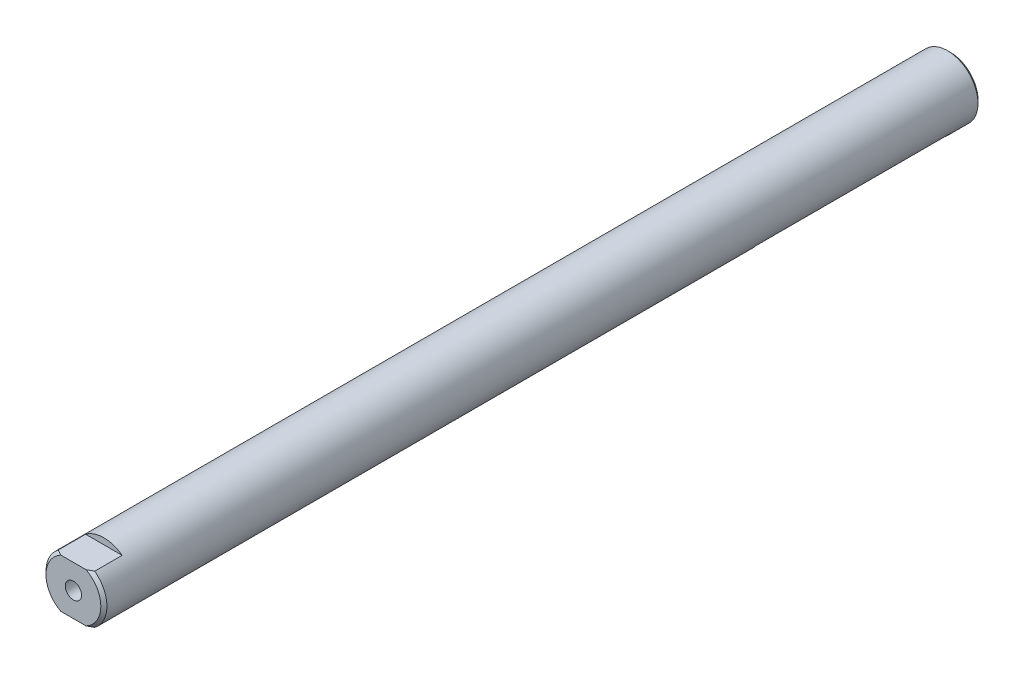
ISO-10303-21;
HEADER;
FILE_DESCRIPTION(('STEP AP214'),'2;1');
FILE_NAME('part.step','',(''),(''),'','','');
FILE_SCHEMA(('AUTOMOTIVE_DESIGN { 1 0 10303 214 1 1 1 1 }'));
ENDSEC;
DATA;
#1=APPLICATION_CONTEXT('core data for automotive mechanical design processes');
#2=APPLICATION_PROTOCOL_DEFINITION('international standard','automotive_design',2000,#1);
#3=PRODUCT_CONTEXT('',#1,'mechanical');
#4=PRODUCT('Part','Part','',(#3));
#5=PRODUCT_RELATED_PRODUCT_CATEGORY('part','',(#4));
#6=PRODUCT_DEFINITION_FORMATION('','',#4);
#7=PRODUCT_DEFINITION_CONTEXT('part definition',#1,'design');
#8=PRODUCT_DEFINITION('design','',#6,#7);
#9=PRODUCT_DEFINITION_SHAPE('','',#8);
#10=(LENGTH_UNIT() NAMED_UNIT(*) SI_UNIT(.MILLI.,.METRE.));
#11=(NAMED_UNIT(*) PLANE_ANGLE_UNIT() SI_UNIT($,.RADIAN.));
#12=(NAMED_UNIT(*) SI_UNIT($,.STERADIAN.) SOLID_ANGLE_UNIT());
#13=UNCERTAINTY_MEASURE_WITH_UNIT(LENGTH_MEASURE(1.E-05),#10,'distance_accuracy_value','');
#14=(GEOMETRIC_REPRESENTATION_CONTEXT(3) GLOBAL_UNCERTAINTY_ASSIGNED_CONTEXT((#13)) GLOBAL_UNIT_ASSIGNED_CONTEXT((#10,
#11,#12)) REPRESENTATION_CONTEXT('',''));
#15=CARTESIAN_POINT('',(0.,0.,0.));
#16=DIRECTION('',(0.,0.,1.));
#17=DIRECTION('',(1.,0.,0.));
#18=AXIS2_PLACEMENT_3D('',#15,#16,#17);
#19=CARTESIAN_POINT('',(0.,0.,228.6));
#20=DIRECTION('',(0.,0.,-1.));
#21=DIRECTION('',(-1.,0.,0.));
#22=AXIS2_PLACEMENT_3D('',#19,#20,#21);
#23=CONICAL_SURFACE('',#22,14.2874999999999,0.78539816339744);
#24=CARTESIAN_POINT('',(-20.9948188362997,12.7,218.350335983573));
#25=CARTESIAN_POINT('',(-20.6810389981544,12.7,218.618804732774));
#26=CARTESIAN_POINT('',(-20.3664721309156,12.7,218.886357316726));
#27=CARTESIAN_POINT('',(-19.7355545060228,12.7,219.419362718427));
#28=CARTESIAN_POINT('',(-19.4192037138988,12.7,219.684815495364));
#29=CARTESIAN_POINT('',(-18.7843580188277,12.7,220.213478769661));
#30=CARTESIAN_POINT('',(-18.4658621006732,12.7,220.4766880489));
#31=CARTESIAN_POINT('',(-17.8266441549003,12.7,221.00038863284));
#32=CARTESIAN_POINT('',(-17.5059221362683,12.7,221.260879948502));
#33=CARTESIAN_POINT('',(-16.8533738177268,12.7,221.785661244857));
#34=CARTESIAN_POINT('',(-16.5214796738842,12.7,222.049866946812));
#35=CARTESIAN_POINT('',(-15.854697810912,12.7,222.574472444557));
#36=CARTESIAN_POINT('',(-15.5198101143849,12.7,222.834872269044));
#37=CARTESIAN_POINT('',(-14.8467056396941,12.7,223.351173728045));
#38=CARTESIAN_POINT('',(-14.5084896634917,12.7,223.607076406674));
#39=CARTESIAN_POINT('',(-13.8281701311778,12.7,224.11366905696));
#40=CARTESIAN_POINT('',(-13.4860665776434,12.7,224.364359032072));
#41=CARTESIAN_POINT('',(-12.7967721374457,12.7,224.860023864054));
#42=CARTESIAN_POINT('',(-12.4495729938879,12.7,225.104987261832));
#43=CARTESIAN_POINT('',(-11.7500506486925,12.7,225.58751304899));
#44=CARTESIAN_POINT('',(-11.3977273876715,12.7,225.825075352498));
#45=CARTESIAN_POINT('',(-10.6868932214396,12.7,226.29148636882));
#46=CARTESIAN_POINT('',(-10.3283770948146,12.7,226.520327149067));
#47=CARTESIAN_POINT('',(-9.60462156620138,12.7,226.967145295869));
#48=CARTESIAN_POINT('',(-9.23938230879352,12.7,227.185122895662));
#49=CARTESIAN_POINT('',(-8.50482232677883,12.7,227.605739392101));
#50=CARTESIAN_POINT('',(-8.13557523539037,12.7,227.808506243445));
#51=CARTESIAN_POINT('',(-7.38862738753812,12.7,228.198039529508));
#52=CARTESIAN_POINT('',(-7.01092565062419,12.7,228.384804096258));
#53=CARTESIAN_POINT('',(-6.24694372230979,12.7,228.738300679871));
#54=CARTESIAN_POINT('',(-5.86067874185389,12.7,228.905065297701));
#55=CARTESIAN_POINT('',(-5.07860833558926,12.7,229.214410810641));
#56=CARTESIAN_POINT('',(-4.68280551684412,12.7,229.356998230575));
#57=CARTESIAN_POINT('',(-3.86926585650531,12.7,229.616923550217));
#58=CARTESIAN_POINT('',(-3.45122968946264,12.7,229.733338300524));
#59=CARTESIAN_POINT('',(-2.60652496572421,12.7,229.929281659109));
#60=CARTESIAN_POINT('',(-2.17985779209242,12.7,230.008816129111));
#61=CARTESIAN_POINT('',(-1.32271329872665,12.7,230.125825087065));
#62=CARTESIAN_POINT('',(-0.89226307482305,12.7,230.163494246296));
#63=CARTESIAN_POINT('',(-0.0297469888855557,12.7,230.194776960431));
#64=CARTESIAN_POINT('',(0.402318811429393,12.7,230.18839218146));
#65=CARTESIAN_POINT('',(1.26277243834431,12.7,230.132088992262));
#66=CARTESIAN_POINT('',(1.6911654471833,12.7,230.082248181792));
#67=CARTESIAN_POINT('',(2.54130881142096,12.7,229.942531658501));
#68=CARTESIAN_POINT('',(2.96305806095029,12.7,229.852649352082));
#69=CARTESIAN_POINT('',(3.80002602264688,12.7,229.637387299877));
#70=CARTESIAN_POINT('',(4.21518936098779,12.7,229.511794823333));
#71=CARTESIAN_POINT('',(4.83020187333967,12.7,229.301341614428));
#72=CARTESIAN_POINT('',(5.03392626223813,12.7,229.227509321276));
#73=CARTESIAN_POINT('',(5.43883446667615,12.7,229.073162346875));
#74=CARTESIAN_POINT('',(5.64001823021926,12.7,228.992647529117));
#75=CARTESIAN_POINT('',(6.36926105525524,12.7,228.687996263877));
#76=CARTESIAN_POINT('',(6.88981055959412,12.7,228.445771006934));
#77=CARTESIAN_POINT('',(7.91497854574205,12.7,227.929538854274));
#78=CARTESIAN_POINT('',(8.41958691329599,12.7,227.655512276938));
#79=CARTESIAN_POINT('',(9.41605100217623,12.7,227.082896746106));
#80=CARTESIAN_POINT('',(9.9078762336554,12.7,226.784255094586));
#81=CARTESIAN_POINT('',(10.8797375560119,12.7,226.168726579235));
#82=CARTESIAN_POINT('',(11.359776164907,12.7,225.851843661591));
#83=CARTESIAN_POINT('',(12.312374837401,12.7,225.202402729927));
#84=CARTESIAN_POINT('',(12.7848894761625,12.7,224.869778391217));
#85=CARTESIAN_POINT('',(13.7218109324975,12.7,224.193300294929));
#86=CARTESIAN_POINT('',(14.1862174033936,12.7,223.849446058994));
#87=CARTESIAN_POINT('',(15.1077211529983,12.7,223.153207664387));
#88=CARTESIAN_POINT('',(15.5648263343014,12.7,222.800833936276));
#89=CARTESIAN_POINT('',(16.4733674697893,12.7,222.088889224434));
#90=CARTESIAN_POINT('',(16.924803567858,12.7,221.729318423971));
#91=CARTESIAN_POINT('',(17.6805264197386,12.7,221.11921262247));
#92=CARTESIAN_POINT('',(17.9860878320288,12.7,220.870252444903));
#93=CARTESIAN_POINT('',(18.595261628336,12.7,220.369872138897));
#94=CARTESIAN_POINT('',(18.8988737322402,12.7,220.118451669464));
#95=CARTESIAN_POINT('',(19.5021312979589,12.7,219.615293067488));
#96=CARTESIAN_POINT('',(19.8017895769666,12.7,219.363570288391));
#97=CARTESIAN_POINT('',(20.3994738760259,12.7,218.858284882059));
#98=CARTESIAN_POINT('',(20.6975001352675,12.7,218.604722537824));
#99=CARTESIAN_POINT('',(20.9948188362997,12.7,218.350335983573));
#100=B_SPLINE_CURVE_WITH_KNOTS('',3,(#24,#25,#26,#27,#28,#29,#30,#31,#32,#33,#34,#35,#36,#37,
#38,#39,#40,#41,#42,#43,#44,#45,#46,#47,#48,#49,#50,#51,#52,#53,#54,#55,#56,#57,#58,#59,#60,#61,
#62,#63,#64,#65,#66,#67,#68,#69,#70,#71,#72,#73,#74,#75,#76,#77,#78,#79,#80,#81,#82,#83,#84,#85,
#86,#87,#88,#89,#90,#91,#92,#93,#94,#95,#96,#97,#98,#99),.UNSPECIFIED.,.F.,.F.,(4,2,2,2,2,2,2,2,
2,2,2,2,2,2,2,2,2,2,2,2,2,2,2,2,2,2,2,2,2,2,2,2,2,2,2,2,2,4),(0.,1.23887197122443,
2.47776796324673,3.71729850973194,4.95682405535293,6.22944510945203,7.50205656288832,
8.77436853917409,10.0466796721009,11.3213499687312,12.5960350493104,13.8718531064865,
15.1476437593001,16.4110961074993,17.6746957399557,18.9362068063337,20.1973768785243,
21.4977685024829,22.7979533722386,24.0920668279409,25.3861313404154,26.6778897541586,
27.9698609592972,29.2696959472478,29.9196717707465,30.5696608751648,32.2904534894359,
34.0123168276933,35.7379673131955,37.463245876527,39.1965859493598,40.9299999532613,
42.6613896046517,44.3927352234191,45.5751531409773,46.7577373291075,47.9317971159513,
49.1056799614727),.UNSPECIFIED.);
#101=CARTESIAN_POINT('',(-9.52500000000003,12.7,227.0125));
#102=VERTEX_POINT('',#101);
#103=CARTESIAN_POINT('',(-6.5454301806678,12.7,228.6));
#104=VERTEX_POINT('',#103);
#105=EDGE_CURVE('E239',#102,#104,#100,.T.);
#106=ORIENTED_EDGE('',*,*,#105,.F.);
#107=CARTESIAN_POINT('',(0.,0.,227.0125));
#108=DIRECTION('',(0.,0.,1.));
#109=DIRECTION('',(1.,0.,0.));
#110=AXIS2_PLACEMENT_3D('',#107,#108,#109);
#111=CIRCLE('',#110,15.875);
#112=CARTESIAN_POINT('',(-9.52500000000003,-12.7,227.0125));
#113=VERTEX_POINT('',#112);
#114=EDGE_CURVE('E161',#113,#102,#111,.F.);
#115=ORIENTED_EDGE('',*,*,#114,.F.);
#116=CARTESIAN_POINT('',(20.9948188362997,-12.7,218.350335983573));
#117=CARTESIAN_POINT('',(20.6810389981544,-12.7,218.618804732774));
#118=CARTESIAN_POINT('',(20.3664721309156,-12.7,218.886357316726));
#119=CARTESIAN_POINT('',(19.7355545060228,-12.7,219.419362718427));
#120=CARTESIAN_POINT('',(19.4192037138988,-12.7,219.684815495364));
#121=CARTESIAN_POINT('',(18.7843580188277,-12.7,220.213478769661));
#122=CARTESIAN_POINT('',(18.4658621006732,-12.7,220.4766880489));
#123=CARTESIAN_POINT('',(17.8266441549003,-12.7,221.00038863284));
#124=CARTESIAN_POINT('',(17.5059221362683,-12.7,221.260879948502));
#125=CARTESIAN_POINT('',(16.8533738177268,-12.7,221.785661244857));
#126=CARTESIAN_POINT('',(16.5214796738842,-12.7,222.049866946812));
#127=CARTESIAN_POINT('',(15.854697810912,-12.7,222.574472444557));
#128=CARTESIAN_POINT('',(15.5198101143849,-12.7,222.834872269044));
#129=CARTESIAN_POINT('',(14.8467056396941,-12.7,223.351173728045));
#130=CARTESIAN_POINT('',(14.5084896634917,-12.7,223.607076406674));
#131=CARTESIAN_POINT('',(13.8281701311778,-12.7,224.11366905696));
#132=CARTESIAN_POINT('',(13.4860665776434,-12.7,224.364359032072));
#133=CARTESIAN_POINT('',(12.7967721374457,-12.7,224.860023864054));
#134=CARTESIAN_POINT('',(12.4495729938879,-12.7,225.104987261832));
#135=CARTESIAN_POINT('',(11.7500506486925,-12.7,225.58751304899));
#136=CARTESIAN_POINT('',(11.3977273876715,-12.7,225.825075352498));
#137=CARTESIAN_POINT('',(10.6868932214396,-12.7,226.29148636882));
#138=CARTESIAN_POINT('',(10.3283770948146,-12.7,226.520327149067));
#139=CARTESIAN_POINT('',(9.60462156620138,-12.7,226.967145295869));
#140=CARTESIAN_POINT('',(9.23938230879352,-12.7,227.185122895662));
#141=CARTESIAN_POINT('',(8.50482232677883,-12.7,227.605739392101));
#142=CARTESIAN_POINT('',(8.13557523539037,-12.7,227.808506243445));
#143=CARTESIAN_POINT('',(7.38862738753812,-12.7,228.198039529508));
#144=CARTESIAN_POINT('',(7.01092565062419,-12.7,228.384804096258));
#145=CARTESIAN_POINT('',(6.24694372230979,-12.7,228.738300679871));
#146=CARTESIAN_POINT('',(5.86067874185389,-12.7,228.905065297701));
#147=CARTESIAN_POINT('',(5.07860833558926,-12.7,229.214410810641));
#148=CARTESIAN_POINT('',(4.68280551684412,-12.7,229.356998230575));
#149=CARTESIAN_POINT('',(3.86926585650531,-12.7,229.616923550217));
#150=CARTESIAN_POINT('',(3.45122968946264,-12.7,229.733338300524));
#151=CARTESIAN_POINT('',(2.60652496572421,-12.7,229.929281659109));
#152=CARTESIAN_POINT('',(2.17985779209242,-12.7,230.008816129111));
#153=CARTESIAN_POINT('',(1.32271329872665,-12.7,230.125825087065));
#154=CARTESIAN_POINT('',(0.89226307482305,-12.7,230.163494246296));
#155=CARTESIAN_POINT('',(0.0297469888855557,-12.7,230.194776960431));
#156=CARTESIAN_POINT('',(-0.402318811429393,-12.7,230.18839218146));
#157=CARTESIAN_POINT('',(-1.26277243834431,-12.7,230.132088992262));
#158=CARTESIAN_POINT('',(-1.6911654471833,-12.7,230.082248181792));
#159=CARTESIAN_POINT('',(-2.54130881142096,-12.7,229.942531658501));
#160=CARTESIAN_POINT('',(-2.96305806095029,-12.7,229.852649352082));
#161=CARTESIAN_POINT('',(-3.80002602264688,-12.7,229.637387299877));
#162=CARTESIAN_POINT('',(-4.21518936098779,-12.7,229.511794823333));
#163=CARTESIAN_POINT('',(-4.83020187333967,-12.7,229.301341614428));
#164=CARTESIAN_POINT('',(-5.03392626223813,-12.7,229.227509321276));
#165=CARTESIAN_POINT('',(-5.43883446667615,-12.7,229.073162346875));
#166=CARTESIAN_POINT('',(-5.64001823021926,-12.7,228.992647529117));
#167=CARTESIAN_POINT('',(-6.36926105525524,-12.7,228.687996263877));
#168=CARTESIAN_POINT('',(-6.88981055959412,-12.7,228.445771006934));
#169=CARTESIAN_POINT('',(-7.91497854574205,-12.7,227.929538854274));
#170=CARTESIAN_POINT('',(-8.41958691329599,-12.7,227.655512276938));
#171=CARTESIAN_POINT('',(-9.41605100217623,-12.7,227.082896746106));
#172=CARTESIAN_POINT('',(-9.9078762336554,-12.7,226.784255094586));
#173=CARTESIAN_POINT('',(-10.8797375560119,-12.7,226.168726579235));
#174=CARTESIAN_POINT('',(-11.359776164907,-12.7,225.851843661591));
#175=CARTESIAN_POINT('',(-12.312374837401,-12.7,225.202402729927));
#176=CARTESIAN_POINT('',(-12.7848894761625,-12.7,224.869778391217));
#177=CARTESIAN_POINT('',(-13.7218109324975,-12.7,224.193300294929));
#178=CARTESIAN_POINT('',(-14.1862174033936,-12.7,223.849446058994));
#179=CARTESIAN_POINT('',(-15.1077211529983,-12.7,223.153207664387));
#180=CARTESIAN_POINT('',(-15.5648263343014,-12.7,222.800833936276));
#181=CARTESIAN_POINT('',(-16.4733674697893,-12.7,222.088889224434));
#182=CARTESIAN_POINT('',(-16.924803567858,-12.7,221.729318423971));
#183=CARTESIAN_POINT('',(-17.6805264197386,-12.7,221.11921262247));
#184=CARTESIAN_POINT('',(-17.9860878320288,-12.7,220.870252444903));
#185=CARTESIAN_POINT('',(-18.595261628336,-12.7,220.369872138897));
#186=CARTESIAN_POINT('',(-18.8988737322402,-12.7,220.118451669464));
#187=CARTESIAN_POINT('',(-19.5021312979589,-12.7,219.615293067488));
#188=CARTESIAN_POINT('',(-19.8017895769666,-12.7,219.363570288391));
#189=CARTESIAN_POINT('',(-20.3994738760259,-12.7,218.858284882059));
#190=CARTESIAN_POINT('',(-20.6975001352675,-12.7,218.604722537824));
#191=CARTESIAN_POINT('',(-20.9948188362997,-12.7,218.350335983573));
#192=B_SPLINE_CURVE_WITH_KNOTS('',3,(#116,#117,#118,#119,#120,#121,#122,#123,#124,#125,#126,
#127,#128,#129,#130,#131,#132,#133,#134,#135,#136,#137,#138,#139,#140,#141,#142,#143,#144,#145,
#146,#147,#148,#149,#150,#151,#152,#153,#154,#155,#156,#157,#158,#159,#160,#161,#162,#163,#164,
#165,#166,#167,#168,#169,#170,#171,#172,#173,#174,#175,#176,#177,#178,#179,#180,#181,#182,#183,
#184,#185,#186,#187,#188,#189,#190,#191),.UNSPECIFIED.,.F.,.F.,(4,2,2,2,2,2,2,2,2,2,2,2,2,2,2,2,
2,2,2,2,2,2,2,2,2,2,2,2,2,2,2,2,2,2,2,2,2,4),(0.,1.23887197122443,2.47776796324673,
3.71729850973194,4.95682405535293,6.22944510945203,7.50205656288832,8.77436853917409,
10.0466796721009,11.3213499687312,12.5960350493104,13.8718531064865,15.1476437593001,
16.4110961074993,17.6746957399557,18.9362068063337,20.1973768785243,21.4977685024829,
22.7979533722386,24.0920668279409,25.3861313404154,26.6778897541586,27.9698609592972,
29.2696959472478,29.9196717707465,30.5696608751648,32.2904534894359,34.0123168276933,
35.7379673131955,37.463245876527,39.1965859493598,40.9299999532613,42.6613896046517,
44.3927352234191,45.5751531409773,46.7577373291075,47.9317971159513,49.1056799614727),.UNSPECIFIED.);
#193=CARTESIAN_POINT('',(-6.54543018066781,-12.7,228.6));
#194=VERTEX_POINT('',#193);
#195=EDGE_CURVE('E165',#194,#113,#192,.T.);
#196=ORIENTED_EDGE('',*,*,#195,.F.);
#197=CARTESIAN_POINT('',(0.,0.,228.6));
#198=DIRECTION('',(0.,0.,1.));
#199=DIRECTION('',(1.,0.,0.));
#200=AXIS2_PLACEMENT_3D('',#197,#198,#199);
#201=CIRCLE('',#200,14.2874999999999);
#202=EDGE_CURVE('E154',#104,#194,#201,.T.);
#203=ORIENTED_EDGE('',*,*,#202,.F.);
#204=EDGE_LOOP('',(#106,#115,#196,#203));
#205=FACE_BOUND('',#204,.T.);
#206=ADVANCED_FACE('F36',(#205),#23,.T.);
#207=CARTESIAN_POINT('',(0.,0.,228.6));
#208=DIRECTION('',(0.,0.,-1.));
#209=DIRECTION('',(-1.,0.,0.));
#210=AXIS2_PLACEMENT_3D('',#207,#208,#209);
#211=CYLINDRICAL_SURFACE('',#210,15.875);
#212=ORIENTED_EDGE('',*,*,#114,.T.);
#213=DIRECTION('',(0.,0.,1.));
#214=VECTOR('',#213,1.);
#215=CARTESIAN_POINT('',(-9.52500000000003,12.7,212.725));
#216=LINE('',#215,#214);
#217=CARTESIAN_POINT('',(-9.52500000000003,12.7,212.725));
#218=VERTEX_POINT('',#217);
#219=EDGE_CURVE('E121',#218,#102,#216,.T.);
#220=ORIENTED_EDGE('',*,*,#219,.F.);
#221=CARTESIAN_POINT('',(0.,0.,212.725));
#222=DIRECTION('',(0.,0.,1.));
#223=DIRECTION('',(1.,0.,0.));
#224=AXIS2_PLACEMENT_3D('',#221,#222,#223);
#225=CIRCLE('',#224,15.875);
#226=CARTESIAN_POINT('',(9.52500000000003,12.7,212.725));
#227=VERTEX_POINT('',#226);
#228=EDGE_CURVE('E11',#227,#218,#225,.T.);
#229=ORIENTED_EDGE('',*,*,#228,.F.);
#230=DIRECTION('',(0.,0.,1.));
#231=VECTOR('',#230,1.);
#232=CARTESIAN_POINT('',(9.52500000000003,12.7,212.725));
#233=LINE('',#232,#231);
#234=CARTESIAN_POINT('',(9.52500000000003,12.7,227.0125));
#235=VERTEX_POINT('',#234);
#236=EDGE_CURVE('E124',#227,#235,#233,.T.);
#237=ORIENTED_EDGE('',*,*,#236,.T.);
#238=CARTESIAN_POINT('',(9.52500000000003,-12.7,227.0125));
#239=VERTEX_POINT('',#238);
#240=EDGE_CURVE('E158',#235,#239,#111,.F.);
#241=ORIENTED_EDGE('',*,*,#240,.T.);
#242=DIRECTION('',(0.,0.,1.));
#243=VECTOR('',#242,1.);
#244=CARTESIAN_POINT('',(9.52500000000003,-12.7,212.725));
#245=LINE('',#244,#243);
#246=CARTESIAN_POINT('',(9.52500000000003,-12.7,212.725));
#247=VERTEX_POINT('',#246);
#248=EDGE_CURVE('E130',#247,#239,#245,.T.);
#249=ORIENTED_EDGE('',*,*,#248,.F.);
#250=CARTESIAN_POINT('',(0.,0.,212.725));
#251=DIRECTION('',(0.,0.,-1.));
#252=DIRECTION('',(-1.,0.,0.));
#253=AXIS2_PLACEMENT_3D('',#250,#251,#252);
#254=CIRCLE('',#253,15.875);
#255=CARTESIAN_POINT('',(-9.52500000000003,-12.7,212.725));
#256=VERTEX_POINT('',#255);
#257=EDGE_CURVE('E44',#247,#256,#254,.T.);
#258=ORIENTED_EDGE('',*,*,#257,.T.);
#259=DIRECTION('',(0.,0.,1.));
#260=VECTOR('',#259,1.);
#261=CARTESIAN_POINT('',(-9.52500000000003,-12.7,212.725));
#262=LINE('',#261,#260);
#263=EDGE_CURVE('E123',#256,#113,#262,.T.);
#264=ORIENTED_EDGE('',*,*,#263,.T.);
#265=EDGE_LOOP('',(#212,#220,#229,#237,#241,#249,#258,#264));
#266=FACE_BOUND('',#265,.T.);
#267=CARTESIAN_POINT('',(0.,0.,-227.0125));
#268=DIRECTION('',(0.,0.,1.));
#269=DIRECTION('',(1.,0.,0.));
#270=AXIS2_PLACEMENT_3D('',#267,#268,#269);
#271=CIRCLE('',#270,15.875);
#272=CARTESIAN_POINT('',(15.875,0.,-227.0125));
#273=VERTEX_POINT('',#272);
#274=EDGE_CURVE('E155',#273,#273,#271,.T.);
#275=ORIENTED_EDGE('',*,*,#274,.T.);
#276=EDGE_LOOP('',(#275));
#277=FACE_BOUND('',#276,.T.);
#278=CARTESIAN_POINT('',(0.,0.,-114.173));
#279=DIRECTION('',(0.,0.,-1.));
#280=DIRECTION('',(-1.,0.,0.));
#281=AXIS2_PLACEMENT_3D('',#278,#279,#280);
#282=CIRCLE('',#281,15.875);
#283=CARTESIAN_POINT('',(12.7,-9.525,-114.173));
#284=VERTEX_POINT('',#283);
#285=CARTESIAN_POINT('',(-12.7,-9.525,-114.173));
#286=VERTEX_POINT('',#285);
#287=EDGE_CURVE('E145',#284,#286,#282,.T.);
#288=ORIENTED_EDGE('',*,*,#287,.F.);
#289=DIRECTION('',(0.,0.,-1.));
#290=VECTOR('',#289,1.);
#291=CARTESIAN_POINT('',(12.7,-9.525,228.6));
#292=LINE('',#291,#290);
#293=CARTESIAN_POINT('',(12.7,-9.525,-216.154));
#294=VERTEX_POINT('',#293);
#295=EDGE_CURVE('E148',#284,#294,#292,.T.);
#296=ORIENTED_EDGE('',*,*,#295,.T.);
#297=CARTESIAN_POINT('',(0.,0.,-216.154));
#298=DIRECTION('',(0.,0.,1.));
#299=DIRECTION('',(1.,0.,0.));
#300=AXIS2_PLACEMENT_3D('',#297,#298,#299);
#301=CIRCLE('',#300,15.875);
#302=CARTESIAN_POINT('',(-12.7,-9.525,-216.154));
#303=VERTEX_POINT('',#302);
#304=EDGE_CURVE('E143',#303,#294,#301,.T.);
#305=ORIENTED_EDGE('',*,*,#304,.F.);
#306=DIRECTION('',(0.,0.,-1.));
#307=VECTOR('',#306,1.);
#308=CARTESIAN_POINT('',(-12.7,-9.525,228.6));
#309=LINE('',#308,#307);
#310=EDGE_CURVE('E140',#303,#286,#309,.F.);
#311=ORIENTED_EDGE('',*,*,#310,.T.);
#312=EDGE_LOOP('',(#288,#296,#305,#311));
#313=FACE_BOUND('',#312,.T.);
#314=ADVANCED_FACE('F205',(#266,#277,#313),#211,.T.);
#315=CARTESIAN_POINT('',(0.,0.,228.6));
#316=DIRECTION('',(0.,0.,1.));
#317=DIRECTION('',(1.,0.,0.));
#318=AXIS2_PLACEMENT_3D('',#315,#316,#317);
#319=PLANE('',#318);
#320=CARTESIAN_POINT('',(0.,0.,228.6));
#321=DIRECTION('',(0.,0.,1.));
#322=DIRECTION('',(1.,0.,0.));
#323=AXIS2_PLACEMENT_3D('',#320,#321,#322);
#324=CIRCLE('',#323,4.25);
#325=CARTESIAN_POINT('',(4.25,0.,228.6));
#326=VERTEX_POINT('',#325);
#327=EDGE_CURVE('E111',#326,#326,#324,.T.);
#328=ORIENTED_EDGE('',*,*,#327,.F.);
#329=EDGE_LOOP('',(#328));
#330=FACE_BOUND('',#329,.T.);
#331=DIRECTION('',(1.,0.,0.));
#332=VECTOR('',#331,1.);
#333=CARTESIAN_POINT('',(-9.52500000000003,12.7,228.6));
#334=LINE('',#333,#332);
#335=CARTESIAN_POINT('',(6.54543018066781,12.7,228.6));
#336=VERTEX_POINT('',#335);
#337=EDGE_CURVE('E59',#104,#336,#334,.T.);
#338=ORIENTED_EDGE('',*,*,#337,.F.);
#339=ORIENTED_EDGE('',*,*,#202,.T.);
#340=DIRECTION('',(-1.,0.,0.));
#341=VECTOR('',#340,1.);
#342=CARTESIAN_POINT('',(-9.52500000000003,-12.7,228.6));
#343=LINE('',#342,#341);
#344=CARTESIAN_POINT('',(6.5454301806678,-12.7,228.6));
#345=VERTEX_POINT('',#344);
#346=EDGE_CURVE('E51',#345,#194,#343,.T.);
#347=ORIENTED_EDGE('',*,*,#346,.F.);
#348=EDGE_CURVE('E151',#345,#336,#201,.T.);
#349=ORIENTED_EDGE('',*,*,#348,.T.);
#350=EDGE_LOOP('',(#338,#339,#347,#349));
#351=FACE_BOUND('',#350,.T.);
#352=ADVANCED_FACE('F202',(#330,#351),#319,.T.);
#353=CARTESIAN_POINT('',(0.,0.,-228.6));
#354=DIRECTION('',(0.,0.,1.));
#355=DIRECTION('',(1.,0.,0.));
#356=AXIS2_PLACEMENT_3D('',#353,#354,#355);
#357=PLANE('',#356);
#358=CARTESIAN_POINT('',(0.,0.,-228.6));
#359=DIRECTION('',(0.,0.,1.));
#360=DIRECTION('',(1.,0.,0.));
#361=AXIS2_PLACEMENT_3D('',#358,#359,#360);
#362=CIRCLE('',#361,14.2875);
#363=CARTESIAN_POINT('',(14.2875,0.,-228.6));
#364=VERTEX_POINT('',#363);
#365=EDGE_CURVE('E162',#364,#364,#362,.F.);
#366=ORIENTED_EDGE('',*,*,#365,.T.);
#367=EDGE_LOOP('',(#366));
#368=FACE_BOUND('',#367,.T.);
#369=ADVANCED_FACE('F200',(#368),#357,.F.);
#370=CARTESIAN_POINT('',(-25.3999999999999,-9.525,-114.173));
#371=DIRECTION('',(0.,0.,-1.));
#372=DIRECTION('',(-1.,0.,0.));
#373=AXIS2_PLACEMENT_3D('',#370,#371,#372);
#374=PLANE('',#373);
#375=ORIENTED_EDGE('',*,*,#287,.T.);
#376=DIRECTION('',(1.,0.,0.));
#377=VECTOR('',#376,1.);
#378=CARTESIAN_POINT('',(-25.3999999999999,-9.525,-114.173));
#379=LINE('',#378,#377);
#380=EDGE_CURVE('E127',#286,#284,#379,.T.);
#381=ORIENTED_EDGE('',*,*,#380,.T.);
#382=EDGE_LOOP('',(#375,#381));
#383=FACE_BOUND('',#382,.T.);
#384=ADVANCED_FACE('F196',(#383),#374,.T.);
#385=CARTESIAN_POINT('',(-25.3999999999999,-9.525,-216.154));
#386=DIRECTION('',(0.,0.,1.));
#387=DIRECTION('',(1.,0.,0.));
#388=AXIS2_PLACEMENT_3D('',#385,#386,#387);
#389=PLANE('',#388);
#390=ORIENTED_EDGE('',*,*,#304,.T.);
#391=DIRECTION('',(-1.,0.,0.));
#392=VECTOR('',#391,1.);
#393=CARTESIAN_POINT('',(-25.3999999999999,-9.525,-216.154));
#394=LINE('',#393,#392);
#395=EDGE_CURVE('E137',#294,#303,#394,.T.);
#396=ORIENTED_EDGE('',*,*,#395,.T.);
#397=EDGE_LOOP('',(#390,#396));
#398=FACE_BOUND('',#397,.T.);
#399=ADVANCED_FACE('F192',(#398),#389,.T.);
#400=CARTESIAN_POINT('',(0.,-9.525,0.));
#401=DIRECTION('',(0.,1.,0.));
#402=DIRECTION('',(0.,0.,1.));
#403=AXIS2_PLACEMENT_3D('',#400,#401,#402);
#404=PLANE('',#403);
#405=ORIENTED_EDGE('',*,*,#380,.F.);
#406=ORIENTED_EDGE('',*,*,#310,.F.);
#407=ORIENTED_EDGE('',*,*,#395,.F.);
#408=ORIENTED_EDGE('',*,*,#295,.F.);
#409=EDGE_LOOP('',(#405,#406,#407,#408));
#410=FACE_BOUND('',#409,.T.);
#411=ADVANCED_FACE('F189',(#410),#404,.F.);
#412=EDGE_CURVE('E173',#336,#235,#100,.T.);
#413=ORIENTED_EDGE('',*,*,#412,.F.);
#414=ORIENTED_EDGE('',*,*,#348,.F.);
#415=EDGE_CURVE('E172',#239,#345,#192,.T.);
#416=ORIENTED_EDGE('',*,*,#415,.F.);
#417=ORIENTED_EDGE('',*,*,#240,.F.);
#418=EDGE_LOOP('',(#413,#414,#416,#417));
#419=FACE_BOUND('',#418,.T.);
#420=ADVANCED_FACE('F179',(#419),#23,.T.);
#421=CARTESIAN_POINT('',(0.,0.,-227.0125));
#422=DIRECTION('',(0.,0.,1.));
#423=DIRECTION('',(1.,0.,0.));
#424=AXIS2_PLACEMENT_3D('',#421,#422,#423);
#425=CONICAL_SURFACE('',#424,15.875,0.785398163397422);
#426=ORIENTED_EDGE('',*,*,#365,.F.);
#427=EDGE_LOOP('',(#426));
#428=FACE_BOUND('',#427,.T.);
#429=ORIENTED_EDGE('',*,*,#274,.F.);
#430=EDGE_LOOP('',(#429));
#431=FACE_BOUND('',#430,.T.);
#432=ADVANCED_FACE('F38',(#428,#431),#425,.T.);
#433=CARTESIAN_POINT('',(0.,0.,212.725));
#434=DIRECTION('',(0.,0.,-1.));
#435=DIRECTION('',(-1.,0.,0.));
#436=AXIS2_PLACEMENT_3D('',#433,#434,#435);
#437=PLANE('',#436);
#438=DIRECTION('',(-1.,0.,0.));
#439=VECTOR('',#438,1.);
#440=CARTESIAN_POINT('',(-9.52500000000003,-12.7,212.725));
#441=LINE('',#440,#439);
#442=EDGE_CURVE('E113',#247,#256,#441,.T.);
#443=ORIENTED_EDGE('',*,*,#442,.T.);
#444=ORIENTED_EDGE('',*,*,#257,.F.);
#445=EDGE_LOOP('',(#443,#444));
#446=FACE_BOUND('',#445,.T.);
#447=ADVANCED_FACE('F188',(#446),#437,.F.);
#448=CARTESIAN_POINT('',(-9.52500000000003,-12.7,212.725));
#449=DIRECTION('',(0.,1.,0.));
#450=DIRECTION('',(0.,0.,1.));
#451=AXIS2_PLACEMENT_3D('',#448,#449,#450);
#452=PLANE('',#451);
#453=ORIENTED_EDGE('',*,*,#415,.T.);
#454=ORIENTED_EDGE('',*,*,#346,.T.);
#455=ORIENTED_EDGE('',*,*,#195,.T.);
#456=ORIENTED_EDGE('',*,*,#263,.F.);
#457=ORIENTED_EDGE('',*,*,#442,.F.);
#458=ORIENTED_EDGE('',*,*,#248,.T.);
#459=EDGE_LOOP('',(#453,#454,#455,#456,#457,#458));
#460=FACE_BOUND('',#459,.T.);
#461=ADVANCED_FACE('F182',(#460),#452,.F.);
#462=CARTESIAN_POINT('',(0.,0.,212.725));
#463=DIRECTION('',(0.,0.,1.));
#464=DIRECTION('',(1.,0.,0.));
#465=AXIS2_PLACEMENT_3D('',#462,#463,#464);
#466=PLANE('',#465);
#467=ORIENTED_EDGE('',*,*,#228,.T.);
#468=DIRECTION('',(1.,0.,0.));
#469=VECTOR('',#468,1.);
#470=CARTESIAN_POINT('',(-9.52500000000003,12.7,212.725));
#471=LINE('',#470,#469);
#472=EDGE_CURVE('E118',#218,#227,#471,.T.);
#473=ORIENTED_EDGE('',*,*,#472,.T.);
#474=EDGE_LOOP('',(#467,#473));
#475=FACE_BOUND('',#474,.T.);
#476=ADVANCED_FACE('F187',(#475),#466,.T.);
#477=CARTESIAN_POINT('',(-9.52500000000003,12.7,212.725));
#478=DIRECTION('',(0.,-1.,0.));
#479=DIRECTION('',(0.,0.,-1.));
#480=AXIS2_PLACEMENT_3D('',#477,#478,#479);
#481=PLANE('',#480);
#482=ORIENTED_EDGE('',*,*,#105,.T.);
#483=ORIENTED_EDGE('',*,*,#337,.T.);
#484=ORIENTED_EDGE('',*,*,#412,.T.);
#485=ORIENTED_EDGE('',*,*,#236,.F.);
#486=ORIENTED_EDGE('',*,*,#472,.F.);
#487=ORIENTED_EDGE('',*,*,#219,.T.);
#488=EDGE_LOOP('',(#482,#483,#484,#485,#486,#487));
#489=FACE_BOUND('',#488,.T.);
#490=ADVANCED_FACE('F105',(#489),#481,.F.);
#491=CARTESIAN_POINT('',(0.,0.,200.914));
#492=DIRECTION('',(0.,0.,1.));
#493=DIRECTION('',(1.,0.,0.));
#494=AXIS2_PLACEMENT_3D('',#491,#492,#493);
#495=CONICAL_SURFACE('',#494,4.25,1.02974425867665);
#496=CARTESIAN_POINT('',(0.,0.,198.360342369133));
#497=VERTEX_POINT('',#496);
#498=VERTEX_LOOP('',#497);
#499=FACE_BOUND('',#498,.T.);
#500=CARTESIAN_POINT('',(0.,0.,200.914));
#501=DIRECTION('',(0.,0.,1.));
#502=DIRECTION('',(1.,0.,0.));
#503=AXIS2_PLACEMENT_3D('',#500,#501,#502);
#504=CIRCLE('',#503,4.25);
#505=CARTESIAN_POINT('',(4.25,0.,200.914));
#506=VERTEX_POINT('',#505);
#507=EDGE_CURVE('E109',#506,#506,#504,.T.);
#508=ORIENTED_EDGE('',*,*,#507,.T.);
#509=EDGE_LOOP('',(#508));
#510=FACE_BOUND('',#509,.T.);
#511=ADVANCED_FACE('F101',(#499,#510),#495,.F.);
#512=CARTESIAN_POINT('',(0.,0.,228.6));
#513=DIRECTION('',(0.,0.,1.));
#514=DIRECTION('',(1.,0.,0.));
#515=AXIS2_PLACEMENT_3D('',#512,#513,#514);
#516=CYLINDRICAL_SURFACE('',#515,4.25);
#517=ORIENTED_EDGE('',*,*,#507,.F.);
#518=EDGE_LOOP('',(#517));
#519=FACE_BOUND('',#518,.T.);
#520=ORIENTED_EDGE('',*,*,#327,.T.);
#521=EDGE_LOOP('',(#520));
#522=FACE_BOUND('',#521,.T.);
#523=ADVANCED_FACE('F104',(#519,#522),#516,.F.);
#524=CLOSED_SHELL('',(#206,#314,#352,#369,#384,#399,#411,#420,#432,#447,#461,#476,#490,#511,#523));
#525=MANIFOLD_SOLID_BREP('B2',#524);
#526=ADVANCED_BREP_SHAPE_REPRESENTATION('',(#18,#525),#14);
#527=SHAPE_DEFINITION_REPRESENTATION(#9,#526);
ENDSEC;
END-ISO-10303-21;
